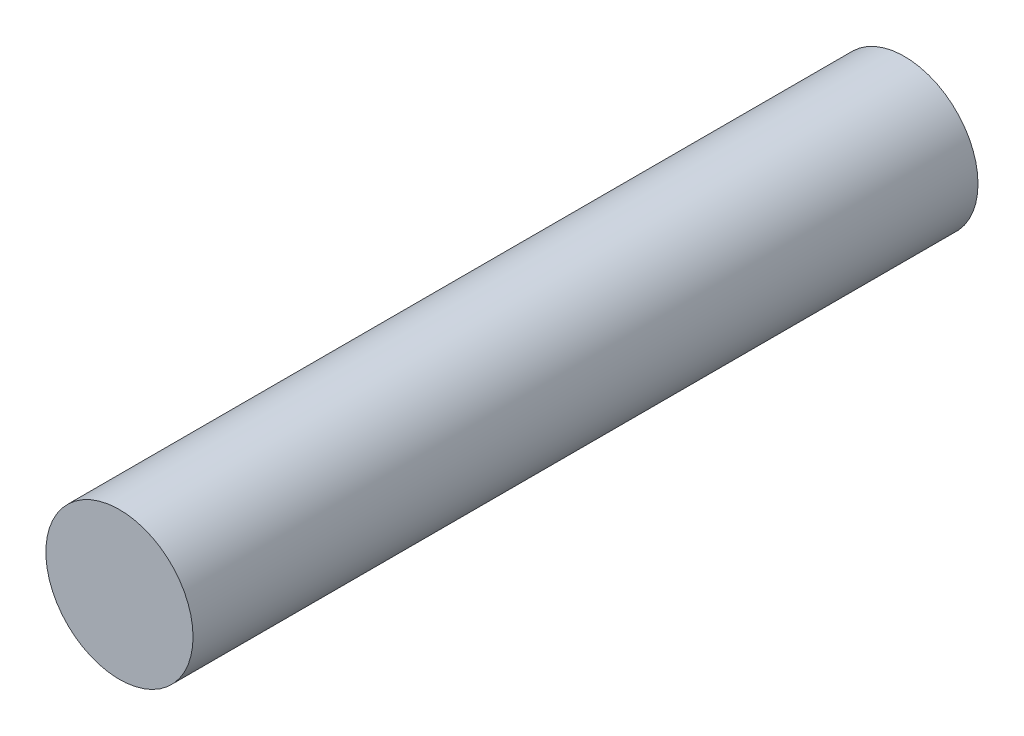
ISO-10303-21;
HEADER;
FILE_DESCRIPTION(('STEP AP214'),'2;1');
FILE_NAME('part.step','',(''),(''),'','','');
FILE_SCHEMA(('AUTOMOTIVE_DESIGN { 1 0 10303 214 1 1 1 1 }'));
ENDSEC;
DATA;
#1=APPLICATION_CONTEXT('core data for automotive mechanical design processes');
#2=APPLICATION_PROTOCOL_DEFINITION('international standard','automotive_design',2000,#1);
#3=PRODUCT_CONTEXT('',#1,'mechanical');
#4=PRODUCT('Part','Part','',(#3));
#5=PRODUCT_RELATED_PRODUCT_CATEGORY('part','',(#4));
#6=PRODUCT_DEFINITION_FORMATION('','',#4);
#7=PRODUCT_DEFINITION_CONTEXT('part definition',#1,'design');
#8=PRODUCT_DEFINITION('design','',#6,#7);
#9=PRODUCT_DEFINITION_SHAPE('','',#8);
#10=(LENGTH_UNIT() NAMED_UNIT(*) SI_UNIT(.MILLI.,.METRE.));
#11=(NAMED_UNIT(*) PLANE_ANGLE_UNIT() SI_UNIT($,.RADIAN.));
#12=(NAMED_UNIT(*) SI_UNIT($,.STERADIAN.) SOLID_ANGLE_UNIT());
#13=UNCERTAINTY_MEASURE_WITH_UNIT(LENGTH_MEASURE(1.E-05),#10,'distance_accuracy_value','');
#14=(GEOMETRIC_REPRESENTATION_CONTEXT(3) GLOBAL_UNCERTAINTY_ASSIGNED_CONTEXT((#13)) GLOBAL_UNIT_ASSIGNED_CONTEXT((#10,
#11,#12)) REPRESENTATION_CONTEXT('',''));
#15=CARTESIAN_POINT('',(0.,0.,0.));
#16=DIRECTION('',(0.,0.,1.));
#17=DIRECTION('',(1.,0.,0.));
#18=AXIS2_PLACEMENT_3D('',#15,#16,#17);
#19=CARTESIAN_POINT('',(0.,0.,-25.4));
#20=DIRECTION('',(0.,0.,1.));
#21=DIRECTION('',(1.,0.,0.));
#22=AXIS2_PLACEMENT_3D('',#19,#20,#21);
#23=CYLINDRICAL_SURFACE('',#22,2.38125);
#24=CARTESIAN_POINT('',(0.,0.,-25.4));
#25=DIRECTION('',(0.,0.,1.));
#26=DIRECTION('',(1.,0.,0.));
#27=AXIS2_PLACEMENT_3D('',#24,#25,#26);
#28=CIRCLE('',#27,2.38125);
#29=CARTESIAN_POINT('',(2.38125,0.,-25.4));
#30=VERTEX_POINT('',#29);
#31=EDGE_CURVE('E10',#30,#30,#28,.T.);
#32=ORIENTED_EDGE('',*,*,#31,.T.);
#33=EDGE_LOOP('',(#32));
#34=FACE_BOUND('',#33,.T.);
#35=CARTESIAN_POINT('',(0.,0.,0.));
#36=DIRECTION('',(0.,0.,1.));
#37=DIRECTION('',(1.,0.,0.));
#38=AXIS2_PLACEMENT_3D('',#35,#36,#37);
#39=CIRCLE('',#38,2.38125);
#40=CARTESIAN_POINT('',(2.38125,0.,0.));
#41=VERTEX_POINT('',#40);
#42=EDGE_CURVE('E34',#41,#41,#39,.T.);
#43=ORIENTED_EDGE('',*,*,#42,.F.);
#44=EDGE_LOOP('',(#43));
#45=FACE_BOUND('',#44,.T.);
#46=ADVANCED_FACE('F31',(#34,#45),#23,.T.);
#47=CARTESIAN_POINT('',(0.,0.,-25.4));
#48=DIRECTION('',(0.,0.,1.));
#49=DIRECTION('',(1.,0.,0.));
#50=AXIS2_PLACEMENT_3D('',#47,#48,#49);
#51=PLANE('',#50);
#52=ORIENTED_EDGE('',*,*,#31,.F.);
#53=EDGE_LOOP('',(#52));
#54=FACE_BOUND('',#53,.T.);
#55=ADVANCED_FACE('F46',(#54),#51,.F.);
#56=CARTESIAN_POINT('',(0.,0.,0.));
#57=DIRECTION('',(0.,0.,1.));
#58=DIRECTION('',(1.,0.,0.));
#59=AXIS2_PLACEMENT_3D('',#56,#57,#58);
#60=PLANE('',#59);
#61=ORIENTED_EDGE('',*,*,#42,.T.);
#62=EDGE_LOOP('',(#61));
#63=FACE_BOUND('',#62,.T.);
#64=ADVANCED_FACE('F43',(#63),#60,.T.);
#65=CLOSED_SHELL('',(#46,#55,#64));
#66=MANIFOLD_SOLID_BREP('B2',#65);
#67=ADVANCED_BREP_SHAPE_REPRESENTATION('',(#18,#66),#14);
#68=SHAPE_DEFINITION_REPRESENTATION(#9,#67);
ENDSEC;
END-ISO-10303-21;
